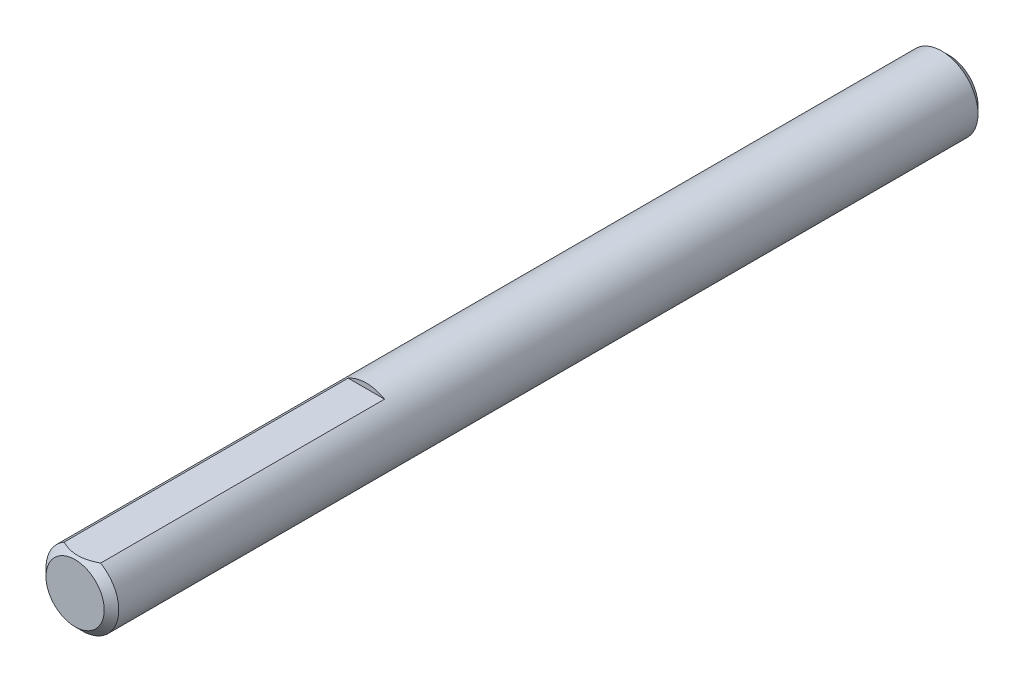
ISO-10303-21;
HEADER;
FILE_DESCRIPTION(('STEP AP214'),'2;1');
FILE_NAME('part.step','',(''),(''),'','','');
FILE_SCHEMA(('AUTOMOTIVE_DESIGN { 1 0 10303 214 1 1 1 1 }'));
ENDSEC;
DATA;
#1=APPLICATION_CONTEXT('core data for automotive mechanical design processes');
#2=APPLICATION_PROTOCOL_DEFINITION('international standard','automotive_design',2000,#1);
#3=PRODUCT_CONTEXT('',#1,'mechanical');
#4=PRODUCT('Part','Part','',(#3));
#5=PRODUCT_RELATED_PRODUCT_CATEGORY('part','',(#4));
#6=PRODUCT_DEFINITION_FORMATION('','',#4);
#7=PRODUCT_DEFINITION_CONTEXT('part definition',#1,'design');
#8=PRODUCT_DEFINITION('design','',#6,#7);
#9=PRODUCT_DEFINITION_SHAPE('','',#8);
#10=(LENGTH_UNIT() NAMED_UNIT(*) SI_UNIT(.MILLI.,.METRE.));
#11=(NAMED_UNIT(*) PLANE_ANGLE_UNIT() SI_UNIT($,.RADIAN.));
#12=(NAMED_UNIT(*) SI_UNIT($,.STERADIAN.) SOLID_ANGLE_UNIT());
#13=UNCERTAINTY_MEASURE_WITH_UNIT(LENGTH_MEASURE(1.E-05),#10,'distance_accuracy_value','');
#14=(GEOMETRIC_REPRESENTATION_CONTEXT(3) GLOBAL_UNCERTAINTY_ASSIGNED_CONTEXT((#13)) GLOBAL_UNIT_ASSIGNED_CONTEXT((#10,
#11,#12)) REPRESENTATION_CONTEXT('',''));
#15=CARTESIAN_POINT('',(0.,0.,0.));
#16=DIRECTION('',(0.,0.,1.));
#17=DIRECTION('',(1.,0.,0.));
#18=AXIS2_PLACEMENT_3D('',#15,#16,#17);
#19=CARTESIAN_POINT('',(0.,0.,38.1));
#20=DIRECTION('',(0.,0.,-1.));
#21=DIRECTION('',(-1.,0.,0.));
#22=AXIS2_PLACEMENT_3D('',#19,#20,#21);
#23=CYLINDRICAL_SURFACE('',#22,3.175);
#24=CARTESIAN_POINT('',(0.,0.,-37.4649999999999));
#25=DIRECTION('',(0.,0.,1.));
#26=DIRECTION('',(1.,0.,0.));
#27=AXIS2_PLACEMENT_3D('',#24,#25,#26);
#28=CIRCLE('',#27,3.175);
#29=CARTESIAN_POINT('',(3.175,0.,-37.4649999999999));
#30=VERTEX_POINT('',#29);
#31=EDGE_CURVE('E78',#30,#30,#28,.T.);
#32=ORIENTED_EDGE('',*,*,#31,.T.);
#33=EDGE_LOOP('',(#32));
#34=FACE_BOUND('',#33,.T.);
#35=DIRECTION('',(0.,0.,-1.));
#36=VECTOR('',#35,1.);
#37=CARTESIAN_POINT('',(1.5875,2.74963065701559,38.1));
#38=LINE('',#37,#36);
#39=CARTESIAN_POINT('',(1.5875,2.74963065701559,37.465));
#40=VERTEX_POINT('',#39);
#41=CARTESIAN_POINT('',(1.5875,2.74963065701559,12.7));
#42=VERTEX_POINT('',#41);
#43=EDGE_CURVE('E66',#40,#42,#38,.T.);
#44=ORIENTED_EDGE('',*,*,#43,.F.);
#45=CARTESIAN_POINT('',(0.,0.,37.465));
#46=DIRECTION('',(0.,0.,1.));
#47=DIRECTION('',(1.,0.,0.));
#48=AXIS2_PLACEMENT_3D('',#45,#46,#47);
#49=CIRCLE('',#48,3.175);
#50=CARTESIAN_POINT('',(-1.5875,2.7496306570156,37.465));
#51=VERTEX_POINT('',#50);
#52=EDGE_CURVE('E76',#40,#51,#49,.F.);
#53=ORIENTED_EDGE('',*,*,#52,.T.);
#54=DIRECTION('',(0.,0.,-1.));
#55=VECTOR('',#54,1.);
#56=CARTESIAN_POINT('',(-1.5875,2.74963065701559,38.1));
#57=LINE('',#56,#55);
#58=CARTESIAN_POINT('',(-1.5875,2.74963065701559,12.7));
#59=VERTEX_POINT('',#58);
#60=EDGE_CURVE('E55',#51,#59,#57,.T.);
#61=ORIENTED_EDGE('',*,*,#60,.T.);
#62=CARTESIAN_POINT('',(0.,0.,12.7));
#63=DIRECTION('',(0.,0.,1.));
#64=DIRECTION('',(1.,0.,0.));
#65=AXIS2_PLACEMENT_3D('',#62,#63,#64);
#66=CIRCLE('',#65,3.175);
#67=EDGE_CURVE('E69',#42,#59,#66,.T.);
#68=ORIENTED_EDGE('',*,*,#67,.F.);
#69=EDGE_LOOP('',(#44,#53,#61,#68));
#70=FACE_BOUND('',#69,.T.);
#71=ADVANCED_FACE('F34',(#34,#70),#23,.T.);
#72=CARTESIAN_POINT('',(0.,0.,38.1));
#73=DIRECTION('',(0.,0.,-1.));
#74=DIRECTION('',(-1.,0.,0.));
#75=AXIS2_PLACEMENT_3D('',#72,#73,#74);
#76=CONICAL_SURFACE('',#75,2.54000000000002,0.785398163397446);
#77=CARTESIAN_POINT('',(0.,0.,38.1));
#78=DIRECTION('',(0.,0.,1.));
#79=DIRECTION('',(1.,0.,0.));
#80=AXIS2_PLACEMENT_3D('',#77,#78,#79);
#81=CIRCLE('',#80,2.54000000000002);
#82=CARTESIAN_POINT('',(2.54000000000002,0.,38.1));
#83=VERTEX_POINT('',#82);
#84=EDGE_CURVE('E48',#83,#83,#81,.T.);
#85=ORIENTED_EDGE('',*,*,#84,.F.);
#86=EDGE_LOOP('',(#85));
#87=FACE_BOUND('',#86,.T.);
#88=ORIENTED_EDGE('',*,*,#52,.F.);
#89=CARTESIAN_POINT('',(-3.2289613522373,2.74963065701559,36.3989317189838));
#90=CARTESIAN_POINT('',(-3.15061649550105,2.74963065701559,36.458566524546));
#91=CARTESIAN_POINT('',(-3.07184009651264,2.74963065701559,36.517643482025));
#92=CARTESIAN_POINT('',(-2.91325130568819,2.74963065701559,36.6344297176183));
#93=CARTESIAN_POINT('',(-2.83343866506295,2.74963065701559,36.6921386575258));
#94=CARTESIAN_POINT('',(-2.67202062852747,2.74963065701559,36.8063475478051));
#95=CARTESIAN_POINT('',(-2.59040613970429,2.74963065701559,36.8628346895372));
#96=CARTESIAN_POINT('',(-2.42580311622164,2.74963065701559,36.9737635143344));
#97=CARTESIAN_POINT('',(-2.34281467809335,2.74963065701559,37.0282053402285));
#98=CARTESIAN_POINT('',(-2.17021447787229,2.74963065701559,37.1377738711657));
#99=CARTESIAN_POINT('',(-2.08050398524193,2.74963065701559,37.1927458353402));
#100=CARTESIAN_POINT('',(-1.89900904678691,2.74963065701559,37.2991469931979));
#101=CARTESIAN_POINT('',(-1.80722487525635,2.74963065701559,37.3505766518349));
#102=CARTESIAN_POINT('',(-1.6215376036893,2.74963065701559,37.4488148050514));
#103=CARTESIAN_POINT('',(-1.52764140922494,2.74963065701559,37.4956362501767));
#104=CARTESIAN_POINT('',(-1.337247065721,2.74963065701559,37.5836008153407));
#105=CARTESIAN_POINT('',(-1.24075014112708,2.74963065701559,37.6247465535942));
#106=CARTESIAN_POINT('',(-1.05364742760749,2.74963065701559,37.6965564372305));
#107=CARTESIAN_POINT('',(-0.963276425588642,2.74963065701559,37.7278260439733));
#108=CARTESIAN_POINT('',(-0.780303735161105,2.74963065701559,37.7831231873505));
#109=CARTESIAN_POINT('',(-0.687701898779464,2.74963065701559,37.8071502421446));
#110=CARTESIAN_POINT('',(-0.502391431282853,2.74963065701559,37.8462882908412));
#111=CARTESIAN_POINT('',(-0.409716445146757,2.74963065701559,37.8615559547489));
#112=CARTESIAN_POINT('',(-0.223306330685268,2.74963065701559,37.8828688420294));
#113=CARTESIAN_POINT('',(-0.12957140343737,2.74963065701559,37.8889157860142));
#114=CARTESIAN_POINT('',(0.0543357559016743,2.74963065701559,37.8913094852485));
#115=CARTESIAN_POINT('',(0.144503242552363,2.74963065701559,37.8880280862278));
#116=CARTESIAN_POINT('',(0.324095543573407,2.74963065701559,37.8727817719638));
#117=CARTESIAN_POINT('',(0.413520286896861,2.74963065701559,37.8608160354814));
#118=CARTESIAN_POINT('',(0.592496066024065,2.74963065701559,37.8286615235361));
#119=CARTESIAN_POINT('',(0.682021177379011,2.74963065701559,37.8083305801752));
#120=CARTESIAN_POINT('',(0.859103373963816,2.74963065701559,37.760545197954));
#121=CARTESIAN_POINT('',(0.946660601088775,2.74963065701559,37.7330912745013));
#122=CARTESIAN_POINT('',(1.21954622680462,2.74963065701559,37.6371294821897));
#123=CARTESIAN_POINT('',(1.40108594012665,2.74963065701559,37.5578094527363));
#124=CARTESIAN_POINT('',(1.66675889489858,2.74963065701559,37.4255539852257));
#125=CARTESIAN_POINT('',(1.75437488385015,2.74963065701559,37.3791526611238));
#126=CARTESIAN_POINT('',(1.92761951465599,2.74963065701559,37.2827692377677));
#127=CARTESIAN_POINT('',(2.01324850705455,2.74963065701559,37.2327877765756));
#128=CARTESIAN_POINT('',(2.17855184285735,2.74963065701559,37.1325138433061));
#129=CARTESIAN_POINT('',(2.258310972488,2.74963065701559,37.0823595590396));
#130=CARTESIAN_POINT('',(2.41646118639996,2.74963065701559,36.9799282177626));
#131=CARTESIAN_POINT('',(2.49485216688177,2.74963065701559,36.9276510006805));
#132=CARTESIAN_POINT('',(2.64980987258628,2.74963065701559,36.8217831250554));
#133=CARTESIAN_POINT('',(2.72638621983958,2.74963065701559,36.7682064917739));
#134=CARTESIAN_POINT('',(2.87849044969166,2.74963065701559,36.6596270900169));
#135=CARTESIAN_POINT('',(2.95401861519261,2.74963065701559,36.6046247183091));
#136=CARTESIAN_POINT('',(3.02910770969622,2.74963065701559,36.5490389555826));
#137=B_SPLINE_CURVE_WITH_KNOTS('',3,(#89,#90,#91,#92,#93,#94,#95,#96,#97,#98,#99,#100,#101,#102,
#103,#104,#105,#106,#107,#108,#109,#110,#111,#112,#113,#114,#115,#116,#117,#118,#119,#120,#121,
#122,#123,#124,#125,#126,#127,#128,#129,#130,#131,#132,#133,#134,#135,#136),.UNSPECIFIED.,.F.,
.F.,(4,2,2,2,2,2,2,2,2,2,2,2,2,2,2,2,2,2,2,2,2,2,2,4),(0.,0.295383449271202,0.590839178498783,
0.888580871622943,1.18630173399069,1.50187785569755,1.81741247644346,2.13203338294821,
2.44650866534175,2.73314264689634,3.01979569373832,3.30114758261624,3.58244696402025,
3.85269226293493,4.12296312107187,4.39803055604397,4.6730780931187,5.2655707124131,
5.56297998480378,5.86033638333464,6.14295523590876,6.42559543796921,6.70595195130115,
6.98623126477261),.UNSPECIFIED.);
#138=EDGE_CURVE('E11',#40,#51,#137,.F.);
#139=ORIENTED_EDGE('',*,*,#138,.T.);
#140=EDGE_LOOP('',(#88,#139));
#141=FACE_BOUND('',#140,.T.);
#142=ADVANCED_FACE('F36',(#87,#141),#76,.T.);
#143=CARTESIAN_POINT('',(0.,0.,38.1));
#144=DIRECTION('',(0.,0.,1.));
#145=DIRECTION('',(1.,0.,0.));
#146=AXIS2_PLACEMENT_3D('',#143,#144,#145);
#147=PLANE('',#146);
#148=ORIENTED_EDGE('',*,*,#84,.T.);
#149=EDGE_LOOP('',(#148));
#150=FACE_BOUND('',#149,.T.);
#151=ADVANCED_FACE('F89',(#150),#147,.T.);
#152=CARTESIAN_POINT('',(0.,0.,-38.1));
#153=DIRECTION('',(0.,0.,1.));
#154=DIRECTION('',(1.,0.,0.));
#155=AXIS2_PLACEMENT_3D('',#152,#153,#154);
#156=PLANE('',#155);
#157=CARTESIAN_POINT('',(0.,0.,-38.1));
#158=DIRECTION('',(0.,0.,1.));
#159=DIRECTION('',(1.,0.,0.));
#160=AXIS2_PLACEMENT_3D('',#157,#158,#159);
#161=CIRCLE('',#160,2.53999999999994);
#162=CARTESIAN_POINT('',(2.53999999999994,0.,-38.1));
#163=VERTEX_POINT('',#162);
#164=EDGE_CURVE('E84',#163,#163,#161,.F.);
#165=ORIENTED_EDGE('',*,*,#164,.T.);
#166=EDGE_LOOP('',(#165));
#167=FACE_BOUND('',#166,.T.);
#168=ADVANCED_FACE('F97',(#167),#156,.F.);
#169=CARTESIAN_POINT('',(0.,0.,-37.4649999999999));
#170=DIRECTION('',(0.,0.,1.));
#171=DIRECTION('',(1.,0.,0.));
#172=AXIS2_PLACEMENT_3D('',#169,#170,#171);
#173=CONICAL_SURFACE('',#172,3.175,0.785398163397446);
#174=ORIENTED_EDGE('',*,*,#164,.F.);
#175=EDGE_LOOP('',(#174));
#176=FACE_BOUND('',#175,.T.);
#177=ORIENTED_EDGE('',*,*,#31,.F.);
#178=EDGE_LOOP('',(#177));
#179=FACE_BOUND('',#178,.T.);
#180=ADVANCED_FACE('F104',(#176,#179),#173,.T.);
#181=CARTESIAN_POINT('',(-1.5875,2.74963065701559,38.1));
#182=DIRECTION('',(0.,1.,0.));
#183=DIRECTION('',(0.,0.,1.));
#184=AXIS2_PLACEMENT_3D('',#181,#182,#183);
#185=PLANE('',#184);
#186=ORIENTED_EDGE('',*,*,#43,.T.);
#187=DIRECTION('',(1.,0.,0.));
#188=VECTOR('',#187,1.);
#189=CARTESIAN_POINT('',(-1.5875,2.74963065701559,12.7));
#190=LINE('',#189,#188);
#191=EDGE_CURVE('E63',#59,#42,#190,.T.);
#192=ORIENTED_EDGE('',*,*,#191,.F.);
#193=ORIENTED_EDGE('',*,*,#60,.F.);
#194=ORIENTED_EDGE('',*,*,#138,.F.);
#195=EDGE_LOOP('',(#186,#192,#193,#194));
#196=FACE_BOUND('',#195,.T.);
#197=ADVANCED_FACE('F65',(#196),#185,.T.);
#198=CARTESIAN_POINT('',(0.,0.,12.7));
#199=DIRECTION('',(0.,0.,1.));
#200=DIRECTION('',(1.,0.,0.));
#201=AXIS2_PLACEMENT_3D('',#198,#199,#200);
#202=PLANE('',#201);
#203=ORIENTED_EDGE('',*,*,#67,.T.);
#204=ORIENTED_EDGE('',*,*,#191,.T.);
#205=EDGE_LOOP('',(#203,#204));
#206=FACE_BOUND('',#205,.T.);
#207=ADVANCED_FACE('F71',(#206),#202,.T.);
#208=CLOSED_SHELL('',(#71,#142,#151,#168,#180,#197,#207));
#209=MANIFOLD_SOLID_BREP('B2',#208);
#210=ADVANCED_BREP_SHAPE_REPRESENTATION('',(#18,#209),#14);
#211=SHAPE_DEFINITION_REPRESENTATION(#9,#210);
ENDSEC;
END-ISO-10303-21;
